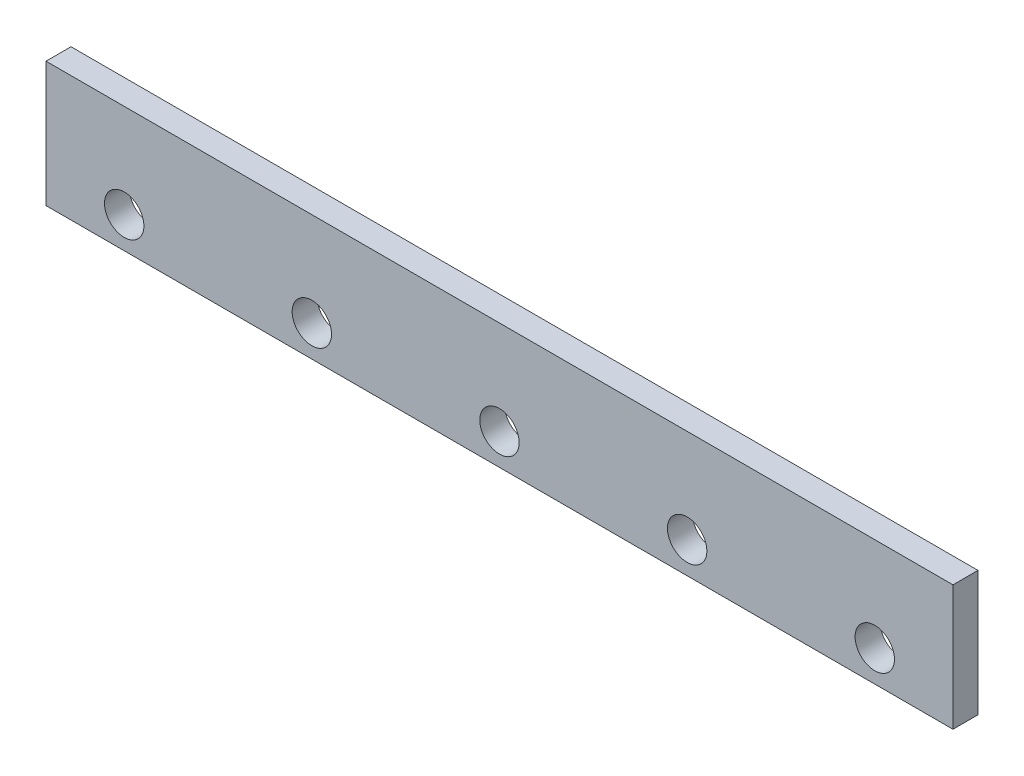
ISO-10303-21;
HEADER;
FILE_DESCRIPTION(('STEP AP214'),'2;1');
FILE_NAME('part.step','',(''),(''),'','','');
FILE_SCHEMA(('AUTOMOTIVE_DESIGN { 1 0 10303 214 1 1 1 1 }'));
ENDSEC;
DATA;
#1=APPLICATION_CONTEXT('core data for automotive mechanical design processes');
#2=APPLICATION_PROTOCOL_DEFINITION('international standard','automotive_design',2000,#1);
#3=PRODUCT_CONTEXT('',#1,'mechanical');
#4=PRODUCT('Part','Part','',(#3));
#5=PRODUCT_RELATED_PRODUCT_CATEGORY('part','',(#4));
#6=PRODUCT_DEFINITION_FORMATION('','',#4);
#7=PRODUCT_DEFINITION_CONTEXT('part definition',#1,'design');
#8=PRODUCT_DEFINITION('design','',#6,#7);
#9=PRODUCT_DEFINITION_SHAPE('','',#8);
#10=(LENGTH_UNIT() NAMED_UNIT(*) SI_UNIT(.MILLI.,.METRE.));
#11=(NAMED_UNIT(*) PLANE_ANGLE_UNIT() SI_UNIT($,.RADIAN.));
#12=(NAMED_UNIT(*) SI_UNIT($,.STERADIAN.) SOLID_ANGLE_UNIT());
#13=UNCERTAINTY_MEASURE_WITH_UNIT(LENGTH_MEASURE(1.E-05),#10,'distance_accuracy_value','');
#14=(GEOMETRIC_REPRESENTATION_CONTEXT(3) GLOBAL_UNCERTAINTY_ASSIGNED_CONTEXT((#13)) GLOBAL_UNIT_ASSIGNED_CONTEXT((#10,
#11,#12)) REPRESENTATION_CONTEXT('',''));
#15=CARTESIAN_POINT('',(0.,0.,0.));
#16=DIRECTION('',(0.,0.,1.));
#17=DIRECTION('',(1.,0.,0.));
#18=AXIS2_PLACEMENT_3D('',#15,#16,#17);
#19=CARTESIAN_POINT('',(0.,0.,16.));
#20=DIRECTION('',(0.,1.,0.));
#21=DIRECTION('',(0.,0.,1.));
#22=AXIS2_PLACEMENT_3D('',#19,#20,#21);
#23=PLANE('',#22);
#24=DIRECTION('',(1.,0.,0.));
#25=VECTOR('',#24,1.);
#26=CARTESIAN_POINT('',(0.,0.,0.));
#27=LINE('',#26,#25);
#28=CARTESIAN_POINT('',(0.,0.,0.));
#29=VERTEX_POINT('',#28);
#30=CARTESIAN_POINT('',(580.,0.,0.));
#31=VERTEX_POINT('',#30);
#32=EDGE_CURVE('E114',#29,#31,#27,.T.);
#33=ORIENTED_EDGE('',*,*,#32,.T.);
#34=DIRECTION('',(0.,0.,-1.));
#35=VECTOR('',#34,1.);
#36=CARTESIAN_POINT('',(580.,0.,16.));
#37=LINE('',#36,#35);
#38=CARTESIAN_POINT('',(580.,0.,16.));
#39=VERTEX_POINT('',#38);
#40=EDGE_CURVE('E11',#39,#31,#37,.T.);
#41=ORIENTED_EDGE('',*,*,#40,.F.);
#42=DIRECTION('',(1.,0.,0.));
#43=VECTOR('',#42,1.);
#44=CARTESIAN_POINT('',(0.,0.,16.));
#45=LINE('',#44,#43);
#46=CARTESIAN_POINT('',(0.,0.,16.));
#47=VERTEX_POINT('',#46);
#48=EDGE_CURVE('E85',#47,#39,#45,.T.);
#49=ORIENTED_EDGE('',*,*,#48,.F.);
#50=DIRECTION('',(0.,0.,-1.));
#51=VECTOR('',#50,1.);
#52=CARTESIAN_POINT('',(0.,0.,16.));
#53=LINE('',#52,#51);
#54=EDGE_CURVE('E52',#47,#29,#53,.T.);
#55=ORIENTED_EDGE('',*,*,#54,.T.);
#56=EDGE_LOOP('',(#33,#41,#49,#55));
#57=FACE_BOUND('',#56,.T.);
#58=ADVANCED_FACE('F35',(#57),#23,.F.);
#59=CARTESIAN_POINT('',(580.,0.,16.));
#60=DIRECTION('',(-1.,0.,0.));
#61=DIRECTION('',(0.,0.,1.));
#62=AXIS2_PLACEMENT_3D('',#59,#60,#61);
#63=PLANE('',#62);
#64=DIRECTION('',(0.,1.,0.));
#65=VECTOR('',#64,1.);
#66=CARTESIAN_POINT('',(580.,0.,0.));
#67=LINE('',#66,#65);
#68=CARTESIAN_POINT('',(580.,80.,0.));
#69=VERTEX_POINT('',#68);
#70=EDGE_CURVE('E90',#31,#69,#67,.T.);
#71=ORIENTED_EDGE('',*,*,#70,.T.);
#72=DIRECTION('',(0.,0.,-1.));
#73=VECTOR('',#72,1.);
#74=CARTESIAN_POINT('',(580.,80.,16.));
#75=LINE('',#74,#73);
#76=CARTESIAN_POINT('',(580.,80.,16.));
#77=VERTEX_POINT('',#76);
#78=EDGE_CURVE('E44',#77,#69,#75,.T.);
#79=ORIENTED_EDGE('',*,*,#78,.F.);
#80=DIRECTION('',(0.,1.,0.));
#81=VECTOR('',#80,1.);
#82=CARTESIAN_POINT('',(580.,0.,16.));
#83=LINE('',#82,#81);
#84=EDGE_CURVE('E77',#39,#77,#83,.T.);
#85=ORIENTED_EDGE('',*,*,#84,.F.);
#86=ORIENTED_EDGE('',*,*,#40,.T.);
#87=EDGE_LOOP('',(#71,#79,#85,#86));
#88=FACE_BOUND('',#87,.T.);
#89=ADVANCED_FACE('F89',(#88),#63,.F.);
#90=CARTESIAN_POINT('',(0.,80.,16.));
#91=DIRECTION('',(0.,1.,0.));
#92=DIRECTION('',(0.,0.,1.));
#93=AXIS2_PLACEMENT_3D('',#90,#91,#92);
#94=PLANE('',#93);
#95=DIRECTION('',(1.,0.,0.));
#96=VECTOR('',#95,1.);
#97=CARTESIAN_POINT('',(0.,80.,0.));
#98=LINE('',#97,#96);
#99=CARTESIAN_POINT('',(0.,80.,0.));
#100=VERTEX_POINT('',#99);
#101=EDGE_CURVE('E117',#100,#69,#98,.T.);
#102=ORIENTED_EDGE('',*,*,#101,.F.);
#103=DIRECTION('',(0.,0.,-1.));
#104=VECTOR('',#103,1.);
#105=CARTESIAN_POINT('',(0.,80.,16.));
#106=LINE('',#105,#104);
#107=CARTESIAN_POINT('',(0.,80.,16.));
#108=VERTEX_POINT('',#107);
#109=EDGE_CURVE('E66',#108,#100,#106,.T.);
#110=ORIENTED_EDGE('',*,*,#109,.F.);
#111=DIRECTION('',(1.,0.,0.));
#112=VECTOR('',#111,1.);
#113=CARTESIAN_POINT('',(0.,80.,16.));
#114=LINE('',#113,#112);
#115=EDGE_CURVE('E84',#108,#77,#114,.T.);
#116=ORIENTED_EDGE('',*,*,#115,.T.);
#117=ORIENTED_EDGE('',*,*,#78,.T.);
#118=EDGE_LOOP('',(#102,#110,#116,#117));
#119=FACE_BOUND('',#118,.T.);
#120=ADVANCED_FACE('F93',(#119),#94,.T.);
#121=CARTESIAN_POINT('',(50.,20.,16.));
#122=DIRECTION('',(0.,0.,-1.));
#123=DIRECTION('',(-1.,0.,0.));
#124=AXIS2_PLACEMENT_3D('',#121,#122,#123);
#125=CYLINDRICAL_SURFACE('',#124,12.6);
#126=CARTESIAN_POINT('',(50.,20.,16.));
#127=DIRECTION('',(0.,0.,1.));
#128=DIRECTION('',(1.,0.,0.));
#129=AXIS2_PLACEMENT_3D('',#126,#127,#128);
#130=CIRCLE('',#129,12.6);
#131=CARTESIAN_POINT('',(62.6,20.,16.));
#132=VERTEX_POINT('',#131);
#133=EDGE_CURVE('E139',#132,#132,#130,.T.);
#134=ORIENTED_EDGE('',*,*,#133,.T.);
#135=EDGE_LOOP('',(#134));
#136=FACE_BOUND('',#135,.T.);
#137=CARTESIAN_POINT('',(50.,20.,0.));
#138=DIRECTION('',(0.,0.,1.));
#139=DIRECTION('',(1.,0.,0.));
#140=AXIS2_PLACEMENT_3D('',#137,#138,#139);
#141=CIRCLE('',#140,12.6);
#142=CARTESIAN_POINT('',(62.6,20.,0.));
#143=VERTEX_POINT('',#142);
#144=EDGE_CURVE('E111',#143,#143,#141,.T.);
#145=ORIENTED_EDGE('',*,*,#144,.F.);
#146=EDGE_LOOP('',(#145));
#147=FACE_BOUND('',#146,.T.);
#148=ADVANCED_FACE('F143',(#136,#147),#125,.F.);
#149=CARTESIAN_POINT('',(170.,20.,16.));
#150=DIRECTION('',(0.,0.,-1.));
#151=DIRECTION('',(-1.,0.,0.));
#152=AXIS2_PLACEMENT_3D('',#149,#150,#151);
#153=CYLINDRICAL_SURFACE('',#152,12.6);
#154=CARTESIAN_POINT('',(170.,20.,16.));
#155=DIRECTION('',(0.,0.,1.));
#156=DIRECTION('',(1.,0.,0.));
#157=AXIS2_PLACEMENT_3D('',#154,#155,#156);
#158=CIRCLE('',#157,12.6);
#159=CARTESIAN_POINT('',(182.6,20.,16.));
#160=VERTEX_POINT('',#159);
#161=EDGE_CURVE('E136',#160,#160,#158,.T.);
#162=ORIENTED_EDGE('',*,*,#161,.T.);
#163=EDGE_LOOP('',(#162));
#164=FACE_BOUND('',#163,.T.);
#165=CARTESIAN_POINT('',(170.,20.,0.));
#166=DIRECTION('',(0.,0.,1.));
#167=DIRECTION('',(1.,0.,0.));
#168=AXIS2_PLACEMENT_3D('',#165,#166,#167);
#169=CIRCLE('',#168,12.6);
#170=CARTESIAN_POINT('',(182.6,20.,0.));
#171=VERTEX_POINT('',#170);
#172=EDGE_CURVE('E108',#171,#171,#169,.T.);
#173=ORIENTED_EDGE('',*,*,#172,.F.);
#174=EDGE_LOOP('',(#173));
#175=FACE_BOUND('',#174,.T.);
#176=ADVANCED_FACE('F169',(#164,#175),#153,.F.);
#177=CARTESIAN_POINT('',(290.,20.,16.));
#178=DIRECTION('',(0.,0.,-1.));
#179=DIRECTION('',(-1.,0.,0.));
#180=AXIS2_PLACEMENT_3D('',#177,#178,#179);
#181=CYLINDRICAL_SURFACE('',#180,12.6);
#182=CARTESIAN_POINT('',(290.,20.,16.));
#183=DIRECTION('',(0.,0.,1.));
#184=DIRECTION('',(1.,0.,0.));
#185=AXIS2_PLACEMENT_3D('',#182,#183,#184);
#186=CIRCLE('',#185,12.6);
#187=CARTESIAN_POINT('',(302.6,20.,16.));
#188=VERTEX_POINT('',#187);
#189=EDGE_CURVE('E131',#188,#188,#186,.T.);
#190=ORIENTED_EDGE('',*,*,#189,.T.);
#191=EDGE_LOOP('',(#190));
#192=FACE_BOUND('',#191,.T.);
#193=CARTESIAN_POINT('',(290.,20.,0.));
#194=DIRECTION('',(0.,0.,1.));
#195=DIRECTION('',(1.,0.,0.));
#196=AXIS2_PLACEMENT_3D('',#193,#194,#195);
#197=CIRCLE('',#196,12.6);
#198=CARTESIAN_POINT('',(302.6,20.,0.));
#199=VERTEX_POINT('',#198);
#200=EDGE_CURVE('E105',#199,#199,#197,.T.);
#201=ORIENTED_EDGE('',*,*,#200,.F.);
#202=EDGE_LOOP('',(#201));
#203=FACE_BOUND('',#202,.T.);
#204=ADVANCED_FACE('F172',(#192,#203),#181,.F.);
#205=CARTESIAN_POINT('',(410.,20.,16.));
#206=DIRECTION('',(0.,0.,-1.));
#207=DIRECTION('',(-1.,0.,0.));
#208=AXIS2_PLACEMENT_3D('',#205,#206,#207);
#209=CYLINDRICAL_SURFACE('',#208,12.6);
#210=CARTESIAN_POINT('',(410.,20.,16.));
#211=DIRECTION('',(0.,0.,1.));
#212=DIRECTION('',(1.,0.,0.));
#213=AXIS2_PLACEMENT_3D('',#210,#211,#212);
#214=CIRCLE('',#213,12.6);
#215=CARTESIAN_POINT('',(422.6,20.,16.));
#216=VERTEX_POINT('',#215);
#217=EDGE_CURVE('E126',#216,#216,#214,.T.);
#218=ORIENTED_EDGE('',*,*,#217,.T.);
#219=EDGE_LOOP('',(#218));
#220=FACE_BOUND('',#219,.T.);
#221=CARTESIAN_POINT('',(410.,20.,0.));
#222=DIRECTION('',(0.,0.,1.));
#223=DIRECTION('',(1.,0.,0.));
#224=AXIS2_PLACEMENT_3D('',#221,#222,#223);
#225=CIRCLE('',#224,12.6);
#226=CARTESIAN_POINT('',(422.6,20.,0.));
#227=VERTEX_POINT('',#226);
#228=EDGE_CURVE('E102',#227,#227,#225,.T.);
#229=ORIENTED_EDGE('',*,*,#228,.F.);
#230=EDGE_LOOP('',(#229));
#231=FACE_BOUND('',#230,.T.);
#232=ADVANCED_FACE('F175',(#220,#231),#209,.F.);
#233=CARTESIAN_POINT('',(530.,20.,16.));
#234=DIRECTION('',(0.,0.,-1.));
#235=DIRECTION('',(-1.,0.,0.));
#236=AXIS2_PLACEMENT_3D('',#233,#234,#235);
#237=CYLINDRICAL_SURFACE('',#236,12.5999999999999);
#238=CARTESIAN_POINT('',(530.,20.,16.));
#239=DIRECTION('',(0.,0.,1.));
#240=DIRECTION('',(1.,0.,0.));
#241=AXIS2_PLACEMENT_3D('',#238,#239,#240);
#242=CIRCLE('',#241,12.5999999999999);
#243=CARTESIAN_POINT('',(542.6,20.,16.));
#244=VERTEX_POINT('',#243);
#245=EDGE_CURVE('E122',#244,#244,#242,.T.);
#246=ORIENTED_EDGE('',*,*,#245,.T.);
#247=EDGE_LOOP('',(#246));
#248=FACE_BOUND('',#247,.T.);
#249=CARTESIAN_POINT('',(530.,20.,0.));
#250=DIRECTION('',(0.,0.,1.));
#251=DIRECTION('',(1.,0.,0.));
#252=AXIS2_PLACEMENT_3D('',#249,#250,#251);
#253=CIRCLE('',#252,12.5999999999999);
#254=CARTESIAN_POINT('',(542.6,20.,0.));
#255=VERTEX_POINT('',#254);
#256=EDGE_CURVE('E99',#255,#255,#253,.T.);
#257=ORIENTED_EDGE('',*,*,#256,.F.);
#258=EDGE_LOOP('',(#257));
#259=FACE_BOUND('',#258,.T.);
#260=ADVANCED_FACE('F37',(#248,#259),#237,.F.);
#261=CARTESIAN_POINT('',(0.,0.,16.));
#262=DIRECTION('',(-1.,0.,0.));
#263=DIRECTION('',(0.,0.,1.));
#264=AXIS2_PLACEMENT_3D('',#261,#262,#263);
#265=PLANE('',#264);
#266=DIRECTION('',(0.,1.,0.));
#267=VECTOR('',#266,1.);
#268=CARTESIAN_POINT('',(0.,0.,0.));
#269=LINE('',#268,#267);
#270=EDGE_CURVE('E119',#29,#100,#269,.T.);
#271=ORIENTED_EDGE('',*,*,#270,.F.);
#272=ORIENTED_EDGE('',*,*,#54,.F.);
#273=DIRECTION('',(0.,1.,0.));
#274=VECTOR('',#273,1.);
#275=CARTESIAN_POINT('',(0.,0.,16.));
#276=LINE('',#275,#274);
#277=EDGE_CURVE('E94',#47,#108,#276,.T.);
#278=ORIENTED_EDGE('',*,*,#277,.T.);
#279=ORIENTED_EDGE('',*,*,#109,.T.);
#280=EDGE_LOOP('',(#271,#272,#278,#279));
#281=FACE_BOUND('',#280,.T.);
#282=ADVANCED_FACE('F148',(#281),#265,.T.);
#283=CARTESIAN_POINT('',(0.,0.,16.));
#284=DIRECTION('',(0.,0.,1.));
#285=DIRECTION('',(1.,0.,0.));
#286=AXIS2_PLACEMENT_3D('',#283,#284,#285);
#287=PLANE('',#286);
#288=ORIENTED_EDGE('',*,*,#245,.F.);
#289=EDGE_LOOP('',(#288));
#290=FACE_BOUND('',#289,.T.);
#291=ORIENTED_EDGE('',*,*,#217,.F.);
#292=EDGE_LOOP('',(#291));
#293=FACE_BOUND('',#292,.T.);
#294=ORIENTED_EDGE('',*,*,#189,.F.);
#295=EDGE_LOOP('',(#294));
#296=FACE_BOUND('',#295,.T.);
#297=ORIENTED_EDGE('',*,*,#161,.F.);
#298=EDGE_LOOP('',(#297));
#299=FACE_BOUND('',#298,.T.);
#300=ORIENTED_EDGE('',*,*,#133,.F.);
#301=EDGE_LOOP('',(#300));
#302=FACE_BOUND('',#301,.T.);
#303=ORIENTED_EDGE('',*,*,#48,.T.);
#304=ORIENTED_EDGE('',*,*,#84,.T.);
#305=ORIENTED_EDGE('',*,*,#115,.F.);
#306=ORIENTED_EDGE('',*,*,#277,.F.);
#307=EDGE_LOOP('',(#303,#304,#305,#306));
#308=FACE_BOUND('',#307,.T.);
#309=ADVANCED_FACE('F81',(#290,#293,#296,#299,#302,#308),#287,.T.);
#310=CARTESIAN_POINT('',(0.,0.,0.));
#311=DIRECTION('',(0.,0.,1.));
#312=DIRECTION('',(1.,0.,0.));
#313=AXIS2_PLACEMENT_3D('',#310,#311,#312);
#314=PLANE('',#313);
#315=ORIENTED_EDGE('',*,*,#256,.T.);
#316=EDGE_LOOP('',(#315));
#317=FACE_BOUND('',#316,.T.);
#318=ORIENTED_EDGE('',*,*,#228,.T.);
#319=EDGE_LOOP('',(#318));
#320=FACE_BOUND('',#319,.T.);
#321=ORIENTED_EDGE('',*,*,#200,.T.);
#322=EDGE_LOOP('',(#321));
#323=FACE_BOUND('',#322,.T.);
#324=ORIENTED_EDGE('',*,*,#172,.T.);
#325=EDGE_LOOP('',(#324));
#326=FACE_BOUND('',#325,.T.);
#327=ORIENTED_EDGE('',*,*,#144,.T.);
#328=EDGE_LOOP('',(#327));
#329=FACE_BOUND('',#328,.T.);
#330=ORIENTED_EDGE('',*,*,#32,.F.);
#331=ORIENTED_EDGE('',*,*,#270,.T.);
#332=ORIENTED_EDGE('',*,*,#101,.T.);
#333=ORIENTED_EDGE('',*,*,#70,.F.);
#334=EDGE_LOOP('',(#330,#331,#332,#333));
#335=FACE_BOUND('',#334,.T.);
#336=ADVANCED_FACE('F147',(#317,#320,#323,#326,#329,#335),#314,.F.);
#337=CLOSED_SHELL('',(#58,#89,#120,#148,#176,#204,#232,#260,#282,#309,#336));
#338=MANIFOLD_SOLID_BREP('B2',#337);
#339=ADVANCED_BREP_SHAPE_REPRESENTATION('',(#18,#338),#14);
#340=SHAPE_DEFINITION_REPRESENTATION(#9,#339);
ENDSEC;
END-ISO-10303-21;
